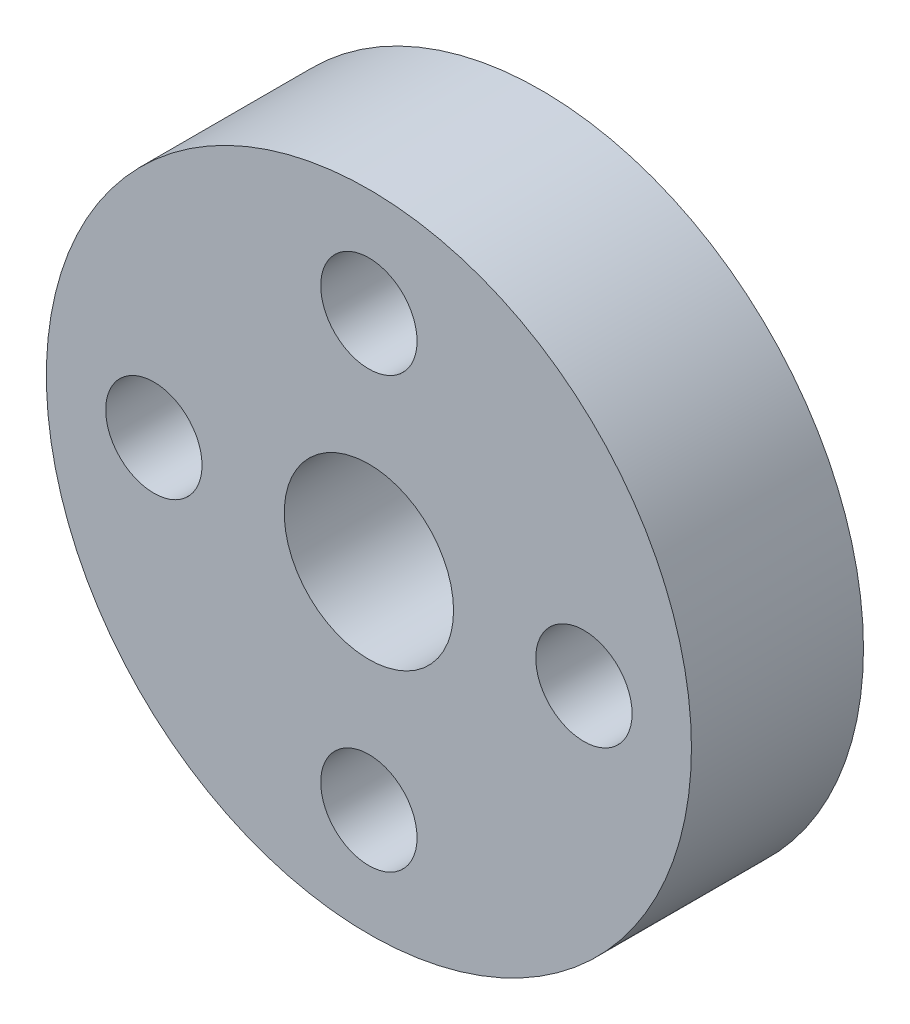
ISO-10303-21;
HEADER;
FILE_DESCRIPTION(('STEP AP214'),'2;1');
FILE_NAME('part.step','',(''),(''),'','','');
FILE_SCHEMA(('AUTOMOTIVE_DESIGN { 1 0 10303 214 1 1 1 1 }'));
ENDSEC;
DATA;
#1=APPLICATION_CONTEXT('core data for automotive mechanical design processes');
#2=APPLICATION_PROTOCOL_DEFINITION('international standard','automotive_design',2000,#1);
#3=PRODUCT_CONTEXT('',#1,'mechanical');
#4=PRODUCT('Part','Part','',(#3));
#5=PRODUCT_RELATED_PRODUCT_CATEGORY('part','',(#4));
#6=PRODUCT_DEFINITION_FORMATION('','',#4);
#7=PRODUCT_DEFINITION_CONTEXT('part definition',#1,'design');
#8=PRODUCT_DEFINITION('design','',#6,#7);
#9=PRODUCT_DEFINITION_SHAPE('','',#8);
#10=(LENGTH_UNIT() NAMED_UNIT(*) SI_UNIT(.MILLI.,.METRE.));
#11=(NAMED_UNIT(*) PLANE_ANGLE_UNIT() SI_UNIT($,.RADIAN.));
#12=(NAMED_UNIT(*) SI_UNIT($,.STERADIAN.) SOLID_ANGLE_UNIT());
#13=UNCERTAINTY_MEASURE_WITH_UNIT(LENGTH_MEASURE(1.E-05),#10,'distance_accuracy_value','');
#14=(GEOMETRIC_REPRESENTATION_CONTEXT(3) GLOBAL_UNCERTAINTY_ASSIGNED_CONTEXT((#13)) GLOBAL_UNIT_ASSIGNED_CONTEXT((#10,
#11,#12)) REPRESENTATION_CONTEXT('',''));
#15=CARTESIAN_POINT('',(0.,0.,0.));
#16=DIRECTION('',(0.,0.,1.));
#17=DIRECTION('',(1.,0.,0.));
#18=AXIS2_PLACEMENT_3D('',#15,#16,#17);
#19=CARTESIAN_POINT('',(-49.2669523700892,24.9215870176182,5.08));
#20=DIRECTION('',(0.,0.,1.));
#21=DIRECTION('',(1.,0.,0.));
#22=AXIS2_PLACEMENT_3D('',#19,#20,#21);
#23=PLANE('',#22);
#24=CARTESIAN_POINT('',(-49.2669523700892,18.5715870176182,5.08));
#25=DIRECTION('',(0.,0.,1.));
#26=DIRECTION('',(1.,0.,0.));
#27=AXIS2_PLACEMENT_3D('',#24,#25,#26);
#28=CIRCLE('',#27,1.4225);
#29=CARTESIAN_POINT('',(-47.8444523700892,18.5715870176182,5.08));
#30=VERTEX_POINT('',#29);
#31=EDGE_CURVE('E58',#30,#30,#28,.T.);
#32=ORIENTED_EDGE('',*,*,#31,.F.);
#33=EDGE_LOOP('',(#32));
#34=FACE_BOUND('',#33,.T.);
#35=CARTESIAN_POINT('',(-49.2669523700892,31.2715870176182,5.08));
#36=DIRECTION('',(0.,0.,1.));
#37=DIRECTION('',(1.,0.,0.));
#38=AXIS2_PLACEMENT_3D('',#35,#36,#37);
#39=CIRCLE('',#38,1.4225);
#40=CARTESIAN_POINT('',(-47.8444523700892,31.2715870176182,5.08));
#41=VERTEX_POINT('',#40);
#42=EDGE_CURVE('E46',#41,#41,#39,.T.);
#43=ORIENTED_EDGE('',*,*,#42,.F.);
#44=EDGE_LOOP('',(#43));
#45=FACE_BOUND('',#44,.T.);
#46=CARTESIAN_POINT('',(-49.2669523700892,24.9215870176182,5.08));
#47=DIRECTION('',(0.,0.,1.));
#48=DIRECTION('',(1.,0.,0.));
#49=AXIS2_PLACEMENT_3D('',#46,#47,#48);
#50=CIRCLE('',#49,9.525);
#51=CARTESIAN_POINT('',(-39.7419523700892,24.9215870176182,5.08));
#52=VERTEX_POINT('',#51);
#53=EDGE_CURVE('E10',#52,#52,#50,.T.);
#54=ORIENTED_EDGE('',*,*,#53,.T.);
#55=EDGE_LOOP('',(#54));
#56=FACE_BOUND('',#55,.T.);
#57=CARTESIAN_POINT('',(-49.2669523700892,24.9215870176182,5.08));
#58=DIRECTION('',(0.,0.,1.));
#59=DIRECTION('',(1.,0.,0.));
#60=AXIS2_PLACEMENT_3D('',#57,#58,#59);
#61=CIRCLE('',#60,2.5);
#62=CARTESIAN_POINT('',(-46.7669523700892,24.9215870176182,5.08));
#63=VERTEX_POINT('',#62);
#64=EDGE_CURVE('E41',#63,#63,#61,.T.);
#65=ORIENTED_EDGE('',*,*,#64,.F.);
#66=EDGE_LOOP('',(#65));
#67=FACE_BOUND('',#66,.T.);
#68=CARTESIAN_POINT('',(-42.9169523700892,24.9215870176182,5.08));
#69=DIRECTION('',(0.,0.,1.));
#70=DIRECTION('',(1.,0.,0.));
#71=AXIS2_PLACEMENT_3D('',#68,#69,#70);
#72=CIRCLE('',#71,1.4225);
#73=CARTESIAN_POINT('',(-41.4944523700892,24.9215870176182,5.08));
#74=VERTEX_POINT('',#73);
#75=EDGE_CURVE('E52',#74,#74,#72,.T.);
#76=ORIENTED_EDGE('',*,*,#75,.F.);
#77=EDGE_LOOP('',(#76));
#78=FACE_BOUND('',#77,.T.);
#79=CARTESIAN_POINT('',(-55.6169523700892,24.9215870176182,5.08));
#80=DIRECTION('',(0.,0.,1.));
#81=DIRECTION('',(1.,0.,0.));
#82=AXIS2_PLACEMENT_3D('',#79,#80,#81);
#83=CIRCLE('',#82,1.4225);
#84=CARTESIAN_POINT('',(-54.1944523700892,24.9215870176182,5.08));
#85=VERTEX_POINT('',#84);
#86=EDGE_CURVE('E64',#85,#85,#83,.T.);
#87=ORIENTED_EDGE('',*,*,#86,.F.);
#88=EDGE_LOOP('',(#87));
#89=FACE_BOUND('',#88,.T.);
#90=ADVANCED_FACE('F30',(#34,#45,#56,#67,#78,#89),#23,.T.);
#91=CARTESIAN_POINT('',(-49.2669523700892,24.9215870176182,0.));
#92=DIRECTION('',(0.,0.,1.));
#93=DIRECTION('',(1.,0.,0.));
#94=AXIS2_PLACEMENT_3D('',#91,#92,#93);
#95=PLANE('',#94);
#96=CARTESIAN_POINT('',(-49.2669523700892,18.5715870176182,0.));
#97=DIRECTION('',(0.,0.,1.));
#98=DIRECTION('',(1.,0.,0.));
#99=AXIS2_PLACEMENT_3D('',#96,#97,#98);
#100=CIRCLE('',#99,1.4225);
#101=CARTESIAN_POINT('',(-47.8444523700892,18.5715870176182,0.));
#102=VERTEX_POINT('',#101);
#103=EDGE_CURVE('E61',#102,#102,#100,.T.);
#104=ORIENTED_EDGE('',*,*,#103,.T.);
#105=EDGE_LOOP('',(#104));
#106=FACE_BOUND('',#105,.T.);
#107=CARTESIAN_POINT('',(-49.2669523700892,31.2715870176182,0.));
#108=DIRECTION('',(0.,0.,1.));
#109=DIRECTION('',(1.,0.,0.));
#110=AXIS2_PLACEMENT_3D('',#107,#108,#109);
#111=CIRCLE('',#110,1.4225);
#112=CARTESIAN_POINT('',(-47.8444523700892,31.2715870176182,0.));
#113=VERTEX_POINT('',#112);
#114=EDGE_CURVE('E49',#113,#113,#111,.T.);
#115=ORIENTED_EDGE('',*,*,#114,.T.);
#116=EDGE_LOOP('',(#115));
#117=FACE_BOUND('',#116,.T.);
#118=CARTESIAN_POINT('',(-49.2669523700892,24.9215870176182,0.));
#119=DIRECTION('',(0.,0.,1.));
#120=DIRECTION('',(1.,0.,0.));
#121=AXIS2_PLACEMENT_3D('',#118,#119,#120);
#122=CIRCLE('',#121,9.525);
#123=CARTESIAN_POINT('',(-39.7419523700892,24.9215870176182,0.));
#124=VERTEX_POINT('',#123);
#125=EDGE_CURVE('E34',#124,#124,#122,.T.);
#126=ORIENTED_EDGE('',*,*,#125,.F.);
#127=EDGE_LOOP('',(#126));
#128=FACE_BOUND('',#127,.T.);
#129=CARTESIAN_POINT('',(-49.2669523700892,24.9215870176182,0.));
#130=DIRECTION('',(0.,0.,1.));
#131=DIRECTION('',(1.,0.,0.));
#132=AXIS2_PLACEMENT_3D('',#129,#130,#131);
#133=CIRCLE('',#132,2.5);
#134=CARTESIAN_POINT('',(-46.7669523700892,24.9215870176182,0.));
#135=VERTEX_POINT('',#134);
#136=EDGE_CURVE('E43',#135,#135,#133,.T.);
#137=ORIENTED_EDGE('',*,*,#136,.T.);
#138=EDGE_LOOP('',(#137));
#139=FACE_BOUND('',#138,.T.);
#140=CARTESIAN_POINT('',(-42.9169523700892,24.9215870176182,0.));
#141=DIRECTION('',(0.,0.,1.));
#142=DIRECTION('',(1.,0.,0.));
#143=AXIS2_PLACEMENT_3D('',#140,#141,#142);
#144=CIRCLE('',#143,1.4225);
#145=CARTESIAN_POINT('',(-41.4944523700892,24.9215870176182,0.));
#146=VERTEX_POINT('',#145);
#147=EDGE_CURVE('E55',#146,#146,#144,.T.);
#148=ORIENTED_EDGE('',*,*,#147,.T.);
#149=EDGE_LOOP('',(#148));
#150=FACE_BOUND('',#149,.T.);
#151=CARTESIAN_POINT('',(-55.6169523700892,24.9215870176182,0.));
#152=DIRECTION('',(0.,0.,1.));
#153=DIRECTION('',(1.,0.,0.));
#154=AXIS2_PLACEMENT_3D('',#151,#152,#153);
#155=CIRCLE('',#154,1.4225);
#156=CARTESIAN_POINT('',(-54.1944523700892,24.9215870176182,0.));
#157=VERTEX_POINT('',#156);
#158=EDGE_CURVE('E67',#157,#157,#155,.T.);
#159=ORIENTED_EDGE('',*,*,#158,.T.);
#160=EDGE_LOOP('',(#159));
#161=FACE_BOUND('',#160,.T.);
#162=ADVANCED_FACE('F77',(#106,#117,#128,#139,#150,#161),#95,.F.);
#163=CARTESIAN_POINT('',(-49.2669523700892,24.9215870176182,5.08));
#164=DIRECTION('',(0.,0.,-1.));
#165=DIRECTION('',(-1.,0.,0.));
#166=AXIS2_PLACEMENT_3D('',#163,#164,#165);
#167=CYLINDRICAL_SURFACE('',#166,9.525);
#168=ORIENTED_EDGE('',*,*,#53,.F.);
#169=EDGE_LOOP('',(#168));
#170=FACE_BOUND('',#169,.T.);
#171=ORIENTED_EDGE('',*,*,#125,.T.);
#172=EDGE_LOOP('',(#171));
#173=FACE_BOUND('',#172,.T.);
#174=ADVANCED_FACE('F32',(#170,#173),#167,.T.);
#175=CARTESIAN_POINT('',(-49.2669523700892,24.9215870176182,5.08));
#176=DIRECTION('',(0.,0.,-1.));
#177=DIRECTION('',(-1.,0.,0.));
#178=AXIS2_PLACEMENT_3D('',#175,#176,#177);
#179=CYLINDRICAL_SURFACE('',#178,2.5);
#180=ORIENTED_EDGE('',*,*,#64,.T.);
#181=EDGE_LOOP('',(#180));
#182=FACE_BOUND('',#181,.T.);
#183=ORIENTED_EDGE('',*,*,#136,.F.);
#184=EDGE_LOOP('',(#183));
#185=FACE_BOUND('',#184,.T.);
#186=ADVANCED_FACE('F87',(#182,#185),#179,.F.);
#187=CARTESIAN_POINT('',(-49.2669523700892,31.2715870176182,5.08));
#188=DIRECTION('',(0.,0.,-1.));
#189=DIRECTION('',(-1.,0.,0.));
#190=AXIS2_PLACEMENT_3D('',#187,#188,#189);
#191=CYLINDRICAL_SURFACE('',#190,1.4225);
#192=ORIENTED_EDGE('',*,*,#42,.T.);
#193=EDGE_LOOP('',(#192));
#194=FACE_BOUND('',#193,.T.);
#195=ORIENTED_EDGE('',*,*,#114,.F.);
#196=EDGE_LOOP('',(#195));
#197=FACE_BOUND('',#196,.T.);
#198=ADVANCED_FACE('F90',(#194,#197),#191,.F.);
#199=CARTESIAN_POINT('',(-42.9169523700892,24.9215870176182,5.08));
#200=DIRECTION('',(0.,0.,-1.));
#201=DIRECTION('',(-1.,0.,0.));
#202=AXIS2_PLACEMENT_3D('',#199,#200,#201);
#203=CYLINDRICAL_SURFACE('',#202,1.4225);
#204=ORIENTED_EDGE('',*,*,#75,.T.);
#205=EDGE_LOOP('',(#204));
#206=FACE_BOUND('',#205,.T.);
#207=ORIENTED_EDGE('',*,*,#147,.F.);
#208=EDGE_LOOP('',(#207));
#209=FACE_BOUND('',#208,.T.);
#210=ADVANCED_FACE('F94',(#206,#209),#203,.F.);
#211=CARTESIAN_POINT('',(-49.2669523700892,18.5715870176182,5.08));
#212=DIRECTION('',(0.,0.,-1.));
#213=DIRECTION('',(-1.,0.,0.));
#214=AXIS2_PLACEMENT_3D('',#211,#212,#213);
#215=CYLINDRICAL_SURFACE('',#214,1.4225);
#216=ORIENTED_EDGE('',*,*,#31,.T.);
#217=EDGE_LOOP('',(#216));
#218=FACE_BOUND('',#217,.T.);
#219=ORIENTED_EDGE('',*,*,#103,.F.);
#220=EDGE_LOOP('',(#219));
#221=FACE_BOUND('',#220,.T.);
#222=ADVANCED_FACE('F98',(#218,#221),#215,.F.);
#223=CARTESIAN_POINT('',(-55.6169523700892,24.9215870176182,5.08));
#224=DIRECTION('',(0.,0.,-1.));
#225=DIRECTION('',(-1.,0.,0.));
#226=AXIS2_PLACEMENT_3D('',#223,#224,#225);
#227=CYLINDRICAL_SURFACE('',#226,1.4225);
#228=ORIENTED_EDGE('',*,*,#86,.T.);
#229=EDGE_LOOP('',(#228));
#230=FACE_BOUND('',#229,.T.);
#231=ORIENTED_EDGE('',*,*,#158,.F.);
#232=EDGE_LOOP('',(#231));
#233=FACE_BOUND('',#232,.T.);
#234=ADVANCED_FACE('F73',(#230,#233),#227,.F.);
#235=CLOSED_SHELL('',(#90,#162,#174,#186,#198,#210,#222,#234));
#236=MANIFOLD_SOLID_BREP('B2',#235);
#237=ADVANCED_BREP_SHAPE_REPRESENTATION('',(#18,#236),#14);
#238=SHAPE_DEFINITION_REPRESENTATION(#9,#237);
ENDSEC;
END-ISO-10303-21;
